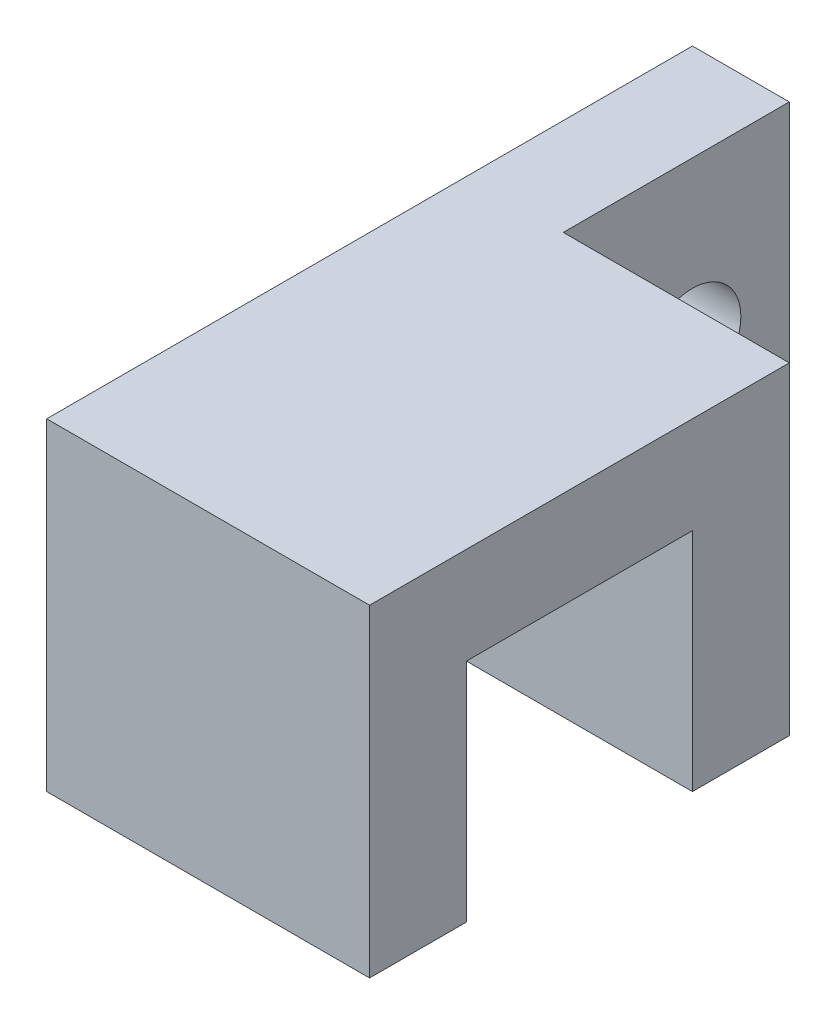
ISO-10303-21;
HEADER;
FILE_DESCRIPTION(('STEP AP214'),'2;1');
FILE_NAME('part.step','',(''),(''),'','','');
FILE_SCHEMA(('AUTOMOTIVE_DESIGN { 1 0 10303 214 1 1 1 1 }'));
ENDSEC;
DATA;
#1=APPLICATION_CONTEXT('core data for automotive mechanical design processes');
#2=APPLICATION_PROTOCOL_DEFINITION('international standard','automotive_design',2000,#1);
#3=PRODUCT_CONTEXT('',#1,'mechanical');
#4=PRODUCT('Part','Part','',(#3));
#5=PRODUCT_RELATED_PRODUCT_CATEGORY('part','',(#4));
#6=PRODUCT_DEFINITION_FORMATION('','',#4);
#7=PRODUCT_DEFINITION_CONTEXT('part definition',#1,'design');
#8=PRODUCT_DEFINITION('design','',#6,#7);
#9=PRODUCT_DEFINITION_SHAPE('','',#8);
#10=(LENGTH_UNIT() NAMED_UNIT(*) SI_UNIT(.MILLI.,.METRE.));
#11=(NAMED_UNIT(*) PLANE_ANGLE_UNIT() SI_UNIT($,.RADIAN.));
#12=(NAMED_UNIT(*) SI_UNIT($,.STERADIAN.) SOLID_ANGLE_UNIT());
#13=UNCERTAINTY_MEASURE_WITH_UNIT(LENGTH_MEASURE(1.E-05),#10,'distance_accuracy_value','');
#14=(GEOMETRIC_REPRESENTATION_CONTEXT(3) GLOBAL_UNCERTAINTY_ASSIGNED_CONTEXT((#13)) GLOBAL_UNIT_ASSIGNED_CONTEXT((#10,
#11,#12)) REPRESENTATION_CONTEXT('',''));
#15=CARTESIAN_POINT('',(0.,0.,0.));
#16=DIRECTION('',(0.,0.,1.));
#17=DIRECTION('',(1.,0.,0.));
#18=AXIS2_PLACEMENT_3D('',#15,#16,#17);
#19=CARTESIAN_POINT('',(0.,63.5,0.));
#20=DIRECTION('',(0.,0.,-1.));
#21=DIRECTION('',(-1.,0.,0.));
#22=AXIS2_PLACEMENT_3D('',#19,#20,#21);
#23=PLANE('',#22);
#24=DIRECTION('',(1.,0.,0.));
#25=VECTOR('',#24,1.);
#26=CARTESIAN_POINT('',(0.,44.45,0.));
#27=LINE('',#26,#25);
#28=CARTESIAN_POINT('',(0.,44.45,0.));
#29=VERTEX_POINT('',#28);
#30=CARTESIAN_POINT('',(63.5,44.45,0.));
#31=VERTEX_POINT('',#30);
#32=EDGE_CURVE('E59',#29,#31,#27,.T.);
#33=ORIENTED_EDGE('',*,*,#32,.F.);
#34=DIRECTION('',(0.,-1.,0.));
#35=VECTOR('',#34,1.);
#36=CARTESIAN_POINT('',(0.,63.5,0.));
#37=LINE('',#36,#35);
#38=CARTESIAN_POINT('',(0.,0.,0.));
#39=VERTEX_POINT('',#38);
#40=EDGE_CURVE('E13',#29,#39,#37,.T.);
#41=ORIENTED_EDGE('',*,*,#40,.T.);
#42=DIRECTION('',(1.,0.,0.));
#43=VECTOR('',#42,1.);
#44=CARTESIAN_POINT('',(0.,0.,0.));
#45=LINE('',#44,#43);
#46=CARTESIAN_POINT('',(63.5,0.,0.));
#47=VERTEX_POINT('',#46);
#48=EDGE_CURVE('E186',#39,#47,#45,.T.);
#49=ORIENTED_EDGE('',*,*,#48,.T.);
#50=DIRECTION('',(0.,-1.,0.));
#51=VECTOR('',#50,1.);
#52=CARTESIAN_POINT('',(63.5,63.5,0.));
#53=LINE('',#52,#51);
#54=EDGE_CURVE('E53',#31,#47,#53,.T.);
#55=ORIENTED_EDGE('',*,*,#54,.F.);
#56=EDGE_LOOP('',(#33,#41,#49,#55));
#57=FACE_BOUND('',#56,.T.);
#58=ADVANCED_FACE('F45',(#57),#23,.F.);
#59=CARTESIAN_POINT('',(0.,63.5,-63.5));
#60=DIRECTION('',(1.,0.,0.));
#61=DIRECTION('',(0.,0.,-1.));
#62=AXIS2_PLACEMENT_3D('',#59,#60,#61);
#63=PLANE('',#62);
#64=CARTESIAN_POINT('',(0.,31.75,-44.45));
#65=DIRECTION('',(1.,0.,0.));
#66=DIRECTION('',(0.,0.,-1.));
#67=AXIS2_PLACEMENT_3D('',#64,#65,#66);
#68=CIRCLE('',#67,9.525);
#69=CARTESIAN_POINT('',(0.,31.75,-53.975));
#70=VERTEX_POINT('',#69);
#71=EDGE_CURVE('E166',#70,#70,#68,.T.);
#72=ORIENTED_EDGE('',*,*,#71,.T.);
#73=EDGE_LOOP('',(#72));
#74=FACE_BOUND('',#73,.T.);
#75=DIRECTION('',(0.,0.,1.));
#76=VECTOR('',#75,1.);
#77=CARTESIAN_POINT('',(0.,0.,-63.5));
#78=LINE('',#77,#76);
#79=CARTESIAN_POINT('',(0.,0.,-63.5));
#80=VERTEX_POINT('',#79);
#81=EDGE_CURVE('E172',#80,#39,#78,.T.);
#82=ORIENTED_EDGE('',*,*,#81,.T.);
#83=ORIENTED_EDGE('',*,*,#40,.F.);
#84=DIRECTION('',(0.,0.,-1.));
#85=VECTOR('',#84,1.);
#86=CARTESIAN_POINT('',(0.,44.45,44.45));
#87=LINE('',#86,#85);
#88=CARTESIAN_POINT('',(0.,44.45,44.45));
#89=VERTEX_POINT('',#88);
#90=EDGE_CURVE('E142',#89,#29,#87,.T.);
#91=ORIENTED_EDGE('',*,*,#90,.F.);
#92=DIRECTION('',(0.,1.,0.));
#93=VECTOR('',#92,1.);
#94=CARTESIAN_POINT('',(0.,0.,44.45));
#95=LINE('',#94,#93);
#96=CARTESIAN_POINT('',(0.,0.,44.45));
#97=VERTEX_POINT('',#96);
#98=EDGE_CURVE('E151',#97,#89,#95,.T.);
#99=ORIENTED_EDGE('',*,*,#98,.F.);
#100=DIRECTION('',(0.,0.,-1.));
#101=VECTOR('',#100,1.);
#102=CARTESIAN_POINT('',(0.,0.,63.5));
#103=LINE('',#102,#101);
#104=CARTESIAN_POINT('',(0.,0.,63.5));
#105=VERTEX_POINT('',#104);
#106=EDGE_CURVE('E148',#105,#97,#103,.T.);
#107=ORIENTED_EDGE('',*,*,#106,.F.);
#108=DIRECTION('',(0.,-1.,0.));
#109=VECTOR('',#108,1.);
#110=CARTESIAN_POINT('',(0.,63.5,63.5));
#111=LINE('',#110,#109);
#112=CARTESIAN_POINT('',(0.,63.5,63.5));
#113=VERTEX_POINT('',#112);
#114=EDGE_CURVE('E138',#113,#105,#111,.T.);
#115=ORIENTED_EDGE('',*,*,#114,.F.);
#116=DIRECTION('',(0.,0.,1.));
#117=VECTOR('',#116,1.);
#118=CARTESIAN_POINT('',(0.,63.5,-63.5));
#119=LINE('',#118,#117);
#120=CARTESIAN_POINT('',(0.,63.5,-63.5));
#121=VERTEX_POINT('',#120);
#122=EDGE_CURVE('E127',#121,#113,#119,.T.);
#123=ORIENTED_EDGE('',*,*,#122,.F.);
#124=DIRECTION('',(0.,-1.,0.));
#125=VECTOR('',#124,1.);
#126=CARTESIAN_POINT('',(0.,63.5,-63.5));
#127=LINE('',#126,#125);
#128=EDGE_CURVE('E184',#121,#80,#127,.T.);
#129=ORIENTED_EDGE('',*,*,#128,.T.);
#130=EDGE_LOOP('',(#82,#83,#91,#99,#107,#115,#123,#129));
#131=FACE_BOUND('',#130,.T.);
#132=ADVANCED_FACE('F47',(#74,#131),#63,.F.);
#133=CARTESIAN_POINT('',(63.5,63.5,0.));
#134=DIRECTION('',(-1.,0.,0.));
#135=DIRECTION('',(0.,0.,1.));
#136=AXIS2_PLACEMENT_3D('',#133,#134,#135);
#137=PLANE('',#136);
#138=DIRECTION('',(0.,0.,-1.));
#139=VECTOR('',#138,1.);
#140=CARTESIAN_POINT('',(63.5,0.,0.));
#141=LINE('',#140,#139);
#142=CARTESIAN_POINT('',(63.5,0.,-19.05));
#143=VERTEX_POINT('',#142);
#144=EDGE_CURVE('E189',#47,#143,#141,.T.);
#145=ORIENTED_EDGE('',*,*,#144,.T.);
#146=DIRECTION('',(0.,-1.,0.));
#147=VECTOR('',#146,1.);
#148=CARTESIAN_POINT('',(63.5,63.5,-19.05));
#149=LINE('',#148,#147);
#150=CARTESIAN_POINT('',(63.5,63.5,-19.05));
#151=VERTEX_POINT('',#150);
#152=EDGE_CURVE('E202',#151,#143,#149,.T.);
#153=ORIENTED_EDGE('',*,*,#152,.F.);
#154=DIRECTION('',(0.,0.,-1.));
#155=VECTOR('',#154,1.);
#156=CARTESIAN_POINT('',(63.5,63.5,0.));
#157=LINE('',#156,#155);
#158=CARTESIAN_POINT('',(63.5,63.5,63.5));
#159=VERTEX_POINT('',#158);
#160=EDGE_CURVE('E101',#159,#151,#157,.T.);
#161=ORIENTED_EDGE('',*,*,#160,.F.);
#162=DIRECTION('',(0.,-1.,0.));
#163=VECTOR('',#162,1.);
#164=CARTESIAN_POINT('',(63.5,63.5,63.5));
#165=LINE('',#164,#163);
#166=CARTESIAN_POINT('',(63.5,0.,63.5));
#167=VERTEX_POINT('',#166);
#168=EDGE_CURVE('E140',#159,#167,#165,.T.);
#169=ORIENTED_EDGE('',*,*,#168,.T.);
#170=DIRECTION('',(0.,0.,-1.));
#171=VECTOR('',#170,1.);
#172=CARTESIAN_POINT('',(63.5,0.,63.5));
#173=LINE('',#172,#171);
#174=CARTESIAN_POINT('',(63.5,0.,44.45));
#175=VERTEX_POINT('',#174);
#176=EDGE_CURVE('E165',#167,#175,#173,.T.);
#177=ORIENTED_EDGE('',*,*,#176,.T.);
#178=DIRECTION('',(0.,1.,0.));
#179=VECTOR('',#178,1.);
#180=CARTESIAN_POINT('',(63.5,0.,44.45));
#181=LINE('',#180,#179);
#182=CARTESIAN_POINT('',(63.5,44.45,44.45));
#183=VERTEX_POINT('',#182);
#184=EDGE_CURVE('E154',#175,#183,#181,.T.);
#185=ORIENTED_EDGE('',*,*,#184,.T.);
#186=DIRECTION('',(0.,0.,-1.));
#187=VECTOR('',#186,1.);
#188=CARTESIAN_POINT('',(63.5,44.45,44.45));
#189=LINE('',#188,#187);
#190=EDGE_CURVE('E149',#183,#31,#189,.T.);
#191=ORIENTED_EDGE('',*,*,#190,.T.);
#192=ORIENTED_EDGE('',*,*,#54,.T.);
#193=EDGE_LOOP('',(#145,#153,#161,#169,#177,#185,#191,#192));
#194=FACE_BOUND('',#193,.T.);
#195=ADVANCED_FACE('F205',(#194),#137,.F.);
#196=CARTESIAN_POINT('',(63.5,63.5,-19.05));
#197=DIRECTION('',(0.,0.,1.));
#198=DIRECTION('',(1.,0.,0.));
#199=AXIS2_PLACEMENT_3D('',#196,#197,#198);
#200=PLANE('',#199);
#201=DIRECTION('',(-1.,0.,0.));
#202=VECTOR('',#201,1.);
#203=CARTESIAN_POINT('',(63.5,0.,-19.05));
#204=LINE('',#203,#202);
#205=CARTESIAN_POINT('',(19.05,0.,-19.05));
#206=VERTEX_POINT('',#205);
#207=EDGE_CURVE('E191',#143,#206,#204,.T.);
#208=ORIENTED_EDGE('',*,*,#207,.T.);
#209=DIRECTION('',(0.,-1.,0.));
#210=VECTOR('',#209,1.);
#211=CARTESIAN_POINT('',(19.05,63.5,-19.05));
#212=LINE('',#211,#210);
#213=CARTESIAN_POINT('',(19.05,63.5,-19.05));
#214=VERTEX_POINT('',#213);
#215=EDGE_CURVE('E199',#214,#206,#212,.T.);
#216=ORIENTED_EDGE('',*,*,#215,.F.);
#217=DIRECTION('',(-1.,0.,0.));
#218=VECTOR('',#217,1.);
#219=CARTESIAN_POINT('',(63.5,63.5,-19.05));
#220=LINE('',#219,#218);
#221=EDGE_CURVE('E179',#151,#214,#220,.T.);
#222=ORIENTED_EDGE('',*,*,#221,.F.);
#223=ORIENTED_EDGE('',*,*,#152,.T.);
#224=EDGE_LOOP('',(#208,#216,#222,#223));
#225=FACE_BOUND('',#224,.T.);
#226=ADVANCED_FACE('F216',(#225),#200,.F.);
#227=CARTESIAN_POINT('',(19.05,63.5,-19.05));
#228=DIRECTION('',(-1.,0.,0.));
#229=DIRECTION('',(0.,0.,1.));
#230=AXIS2_PLACEMENT_3D('',#227,#228,#229);
#231=PLANE('',#230);
#232=CARTESIAN_POINT('',(19.05,31.75,-44.45));
#233=DIRECTION('',(1.,0.,0.));
#234=DIRECTION('',(0.,0.,-1.));
#235=AXIS2_PLACEMENT_3D('',#232,#233,#234);
#236=CIRCLE('',#235,9.525);
#237=CARTESIAN_POINT('',(19.05,31.75,-53.975));
#238=VERTEX_POINT('',#237);
#239=EDGE_CURVE('E157',#238,#238,#236,.T.);
#240=ORIENTED_EDGE('',*,*,#239,.F.);
#241=EDGE_LOOP('',(#240));
#242=FACE_BOUND('',#241,.T.);
#243=DIRECTION('',(0.,0.,-1.));
#244=VECTOR('',#243,1.);
#245=CARTESIAN_POINT('',(19.05,0.,-19.05));
#246=LINE('',#245,#244);
#247=CARTESIAN_POINT('',(19.05,0.,-63.5));
#248=VERTEX_POINT('',#247);
#249=EDGE_CURVE('E193',#206,#248,#246,.T.);
#250=ORIENTED_EDGE('',*,*,#249,.T.);
#251=DIRECTION('',(0.,-1.,0.));
#252=VECTOR('',#251,1.);
#253=CARTESIAN_POINT('',(19.05,63.5,-63.5));
#254=LINE('',#253,#252);
#255=CARTESIAN_POINT('',(19.05,63.5,-63.5));
#256=VERTEX_POINT('',#255);
#257=EDGE_CURVE('E197',#256,#248,#254,.T.);
#258=ORIENTED_EDGE('',*,*,#257,.F.);
#259=DIRECTION('',(0.,0.,-1.));
#260=VECTOR('',#259,1.);
#261=CARTESIAN_POINT('',(19.05,63.5,-19.05));
#262=LINE('',#261,#260);
#263=EDGE_CURVE('E181',#214,#256,#262,.T.);
#264=ORIENTED_EDGE('',*,*,#263,.F.);
#265=ORIENTED_EDGE('',*,*,#215,.T.);
#266=EDGE_LOOP('',(#250,#258,#264,#265));
#267=FACE_BOUND('',#266,.T.);
#268=ADVANCED_FACE('F220',(#242,#267),#231,.F.);
#269=CARTESIAN_POINT('',(19.05,63.5,-63.5));
#270=DIRECTION('',(0.,0.,1.));
#271=DIRECTION('',(1.,0.,0.));
#272=AXIS2_PLACEMENT_3D('',#269,#270,#271);
#273=PLANE('',#272);
#274=DIRECTION('',(-1.,0.,0.));
#275=VECTOR('',#274,1.);
#276=CARTESIAN_POINT('',(19.05,0.,-63.5));
#277=LINE('',#276,#275);
#278=EDGE_CURVE('E94',#248,#80,#277,.T.);
#279=ORIENTED_EDGE('',*,*,#278,.T.);
#280=ORIENTED_EDGE('',*,*,#128,.F.);
#281=DIRECTION('',(-1.,0.,0.));
#282=VECTOR('',#281,1.);
#283=CARTESIAN_POINT('',(19.05,63.5,-63.5));
#284=LINE('',#283,#282);
#285=EDGE_CURVE('E68',#256,#121,#284,.T.);
#286=ORIENTED_EDGE('',*,*,#285,.F.);
#287=ORIENTED_EDGE('',*,*,#257,.T.);
#288=EDGE_LOOP('',(#279,#280,#286,#287));
#289=FACE_BOUND('',#288,.T.);
#290=ADVANCED_FACE('F222',(#289),#273,.F.);
#291=CARTESIAN_POINT('',(0.,63.5,0.));
#292=DIRECTION('',(0.,1.,0.));
#293=DIRECTION('',(0.,0.,1.));
#294=AXIS2_PLACEMENT_3D('',#291,#292,#293);
#295=PLANE('',#294);
#296=ORIENTED_EDGE('',*,*,#122,.T.);
#297=DIRECTION('',(1.,0.,0.));
#298=VECTOR('',#297,1.);
#299=CARTESIAN_POINT('',(0.,63.5,63.5));
#300=LINE('',#299,#298);
#301=EDGE_CURVE('E130',#113,#159,#300,.T.);
#302=ORIENTED_EDGE('',*,*,#301,.T.);
#303=ORIENTED_EDGE('',*,*,#160,.T.);
#304=ORIENTED_EDGE('',*,*,#221,.T.);
#305=ORIENTED_EDGE('',*,*,#263,.T.);
#306=ORIENTED_EDGE('',*,*,#285,.T.);
#307=EDGE_LOOP('',(#296,#302,#303,#304,#305,#306));
#308=FACE_BOUND('',#307,.T.);
#309=ADVANCED_FACE('F129',(#308),#295,.T.);
#310=CARTESIAN_POINT('',(0.,0.,0.));
#311=DIRECTION('',(0.,1.,0.));
#312=DIRECTION('',(0.,0.,1.));
#313=AXIS2_PLACEMENT_3D('',#310,#311,#312);
#314=PLANE('',#313);
#315=ORIENTED_EDGE('',*,*,#81,.F.);
#316=ORIENTED_EDGE('',*,*,#278,.F.);
#317=ORIENTED_EDGE('',*,*,#249,.F.);
#318=ORIENTED_EDGE('',*,*,#207,.F.);
#319=ORIENTED_EDGE('',*,*,#144,.F.);
#320=ORIENTED_EDGE('',*,*,#48,.F.);
#321=EDGE_LOOP('',(#315,#316,#317,#318,#319,#320));
#322=FACE_BOUND('',#321,.T.);
#323=ADVANCED_FACE('F212',(#322),#314,.F.);
#324=CARTESIAN_POINT('',(0.,44.45,44.45));
#325=DIRECTION('',(0.,-1.,0.));
#326=DIRECTION('',(0.,0.,-1.));
#327=AXIS2_PLACEMENT_3D('',#324,#325,#326);
#328=PLANE('',#327);
#329=ORIENTED_EDGE('',*,*,#190,.F.);
#330=DIRECTION('',(1.,0.,0.));
#331=VECTOR('',#330,1.);
#332=CARTESIAN_POINT('',(0.,44.45,44.45));
#333=LINE('',#332,#331);
#334=EDGE_CURVE('E173',#89,#183,#333,.T.);
#335=ORIENTED_EDGE('',*,*,#334,.F.);
#336=ORIENTED_EDGE('',*,*,#90,.T.);
#337=ORIENTED_EDGE('',*,*,#32,.T.);
#338=EDGE_LOOP('',(#329,#335,#336,#337));
#339=FACE_BOUND('',#338,.T.);
#340=ADVANCED_FACE('F225',(#339),#328,.T.);
#341=CARTESIAN_POINT('',(0.,0.,44.45));
#342=DIRECTION('',(0.,0.,-1.));
#343=DIRECTION('',(-1.,0.,0.));
#344=AXIS2_PLACEMENT_3D('',#341,#342,#343);
#345=PLANE('',#344);
#346=ORIENTED_EDGE('',*,*,#184,.F.);
#347=DIRECTION('',(1.,0.,0.));
#348=VECTOR('',#347,1.);
#349=CARTESIAN_POINT('',(0.,0.,44.45));
#350=LINE('',#349,#348);
#351=EDGE_CURVE('E175',#97,#175,#350,.T.);
#352=ORIENTED_EDGE('',*,*,#351,.F.);
#353=ORIENTED_EDGE('',*,*,#98,.T.);
#354=ORIENTED_EDGE('',*,*,#334,.T.);
#355=EDGE_LOOP('',(#346,#352,#353,#354));
#356=FACE_BOUND('',#355,.T.);
#357=ADVANCED_FACE('F228',(#356),#345,.T.);
#358=CARTESIAN_POINT('',(0.,0.,63.5));
#359=DIRECTION('',(0.,-1.,0.));
#360=DIRECTION('',(0.,0.,-1.));
#361=AXIS2_PLACEMENT_3D('',#358,#359,#360);
#362=PLANE('',#361);
#363=ORIENTED_EDGE('',*,*,#176,.F.);
#364=DIRECTION('',(1.,0.,0.));
#365=VECTOR('',#364,1.);
#366=CARTESIAN_POINT('',(0.,0.,63.5));
#367=LINE('',#366,#365);
#368=EDGE_CURVE('E141',#105,#167,#367,.T.);
#369=ORIENTED_EDGE('',*,*,#368,.F.);
#370=ORIENTED_EDGE('',*,*,#106,.T.);
#371=ORIENTED_EDGE('',*,*,#351,.T.);
#372=EDGE_LOOP('',(#363,#369,#370,#371));
#373=FACE_BOUND('',#372,.T.);
#374=ADVANCED_FACE('F231',(#373),#362,.T.);
#375=CARTESIAN_POINT('',(0.,63.5,63.5));
#376=DIRECTION('',(0.,0.,1.));
#377=DIRECTION('',(0.,-1.,0.));
#378=AXIS2_PLACEMENT_3D('',#375,#376,#377);
#379=PLANE('',#378);
#380=ORIENTED_EDGE('',*,*,#168,.F.);
#381=ORIENTED_EDGE('',*,*,#301,.F.);
#382=ORIENTED_EDGE('',*,*,#114,.T.);
#383=ORIENTED_EDGE('',*,*,#368,.T.);
#384=EDGE_LOOP('',(#380,#381,#382,#383));
#385=FACE_BOUND('',#384,.T.);
#386=ADVANCED_FACE('F137',(#385),#379,.T.);
#387=CARTESIAN_POINT('',(0.,31.75,-44.45));
#388=DIRECTION('',(1.,0.,0.));
#389=DIRECTION('',(0.,0.,-1.));
#390=AXIS2_PLACEMENT_3D('',#387,#388,#389);
#391=CYLINDRICAL_SURFACE('',#390,9.525);
#392=ORIENTED_EDGE('',*,*,#71,.F.);
#393=EDGE_LOOP('',(#392));
#394=FACE_BOUND('',#393,.T.);
#395=ORIENTED_EDGE('',*,*,#239,.T.);
#396=EDGE_LOOP('',(#395));
#397=FACE_BOUND('',#396,.T.);
#398=ADVANCED_FACE('F238',(#394,#397),#391,.F.);
#399=CLOSED_SHELL('',(#58,#132,#195,#226,#268,#290,#309,#323,#340,#357,#374,#386,#398));
#400=MANIFOLD_SOLID_BREP('B2',#399);
#401=ADVANCED_BREP_SHAPE_REPRESENTATION('',(#18,#400),#14);
#402=SHAPE_DEFINITION_REPRESENTATION(#9,#401);
ENDSEC;
END-ISO-10303-21;
